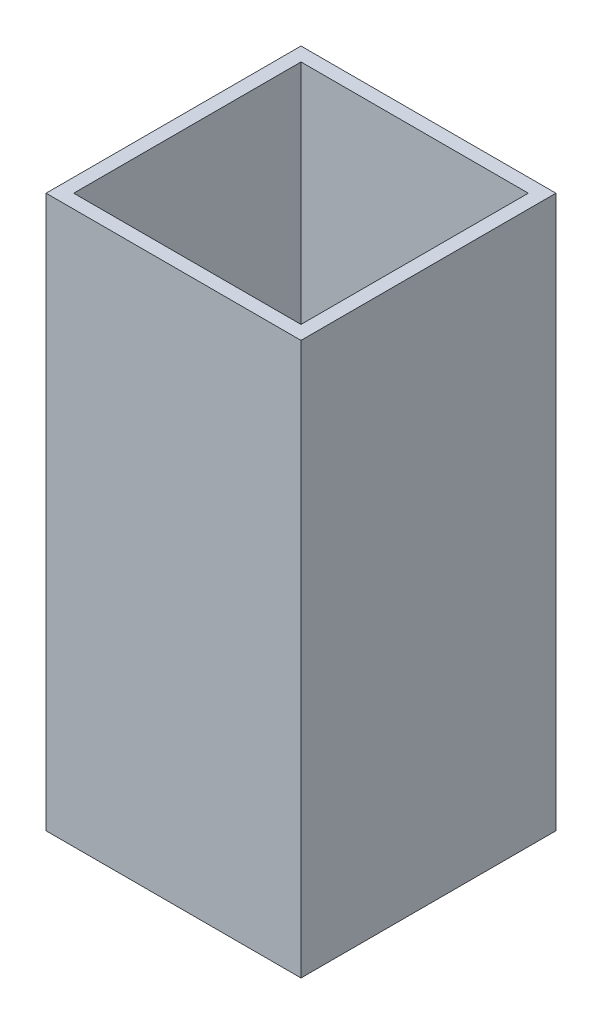
ISO-10303-21;
HEADER;
FILE_DESCRIPTION(('STEP AP214'),'2;1');
FILE_NAME('part.step','',(''),(''),'','','');
FILE_SCHEMA(('AUTOMOTIVE_DESIGN { 1 0 10303 214 1 1 1 1 }'));
ENDSEC;
DATA;
#1=APPLICATION_CONTEXT('core data for automotive mechanical design processes');
#2=APPLICATION_PROTOCOL_DEFINITION('international standard','automotive_design',2000,#1);
#3=PRODUCT_CONTEXT('',#1,'mechanical');
#4=PRODUCT('Part','Part','',(#3));
#5=PRODUCT_RELATED_PRODUCT_CATEGORY('part','',(#4));
#6=PRODUCT_DEFINITION_FORMATION('','',#4);
#7=PRODUCT_DEFINITION_CONTEXT('part definition',#1,'design');
#8=PRODUCT_DEFINITION('design','',#6,#7);
#9=PRODUCT_DEFINITION_SHAPE('','',#8);
#10=(LENGTH_UNIT() NAMED_UNIT(*) SI_UNIT(.MILLI.,.METRE.));
#11=(NAMED_UNIT(*) PLANE_ANGLE_UNIT() SI_UNIT($,.RADIAN.));
#12=(NAMED_UNIT(*) SI_UNIT($,.STERADIAN.) SOLID_ANGLE_UNIT());
#13=UNCERTAINTY_MEASURE_WITH_UNIT(LENGTH_MEASURE(1.E-05),#10,'distance_accuracy_value','');
#14=(GEOMETRIC_REPRESENTATION_CONTEXT(3) GLOBAL_UNCERTAINTY_ASSIGNED_CONTEXT((#13)) GLOBAL_UNIT_ASSIGNED_CONTEXT((#10,
#11,#12)) REPRESENTATION_CONTEXT('',''));
#15=CARTESIAN_POINT('',(0.,0.,0.));
#16=DIRECTION('',(0.,0.,1.));
#17=DIRECTION('',(1.,0.,0.));
#18=AXIS2_PLACEMENT_3D('',#15,#16,#17);
#19=CARTESIAN_POINT('',(1.385,6.,-1.385));
#20=DIRECTION('',(-1.,0.,0.));
#21=DIRECTION('',(0.,0.,1.));
#22=AXIS2_PLACEMENT_3D('',#19,#20,#21);
#23=PLANE('',#22);
#24=DIRECTION('',(0.,0.,-1.));
#25=VECTOR('',#24,1.);
#26=CARTESIAN_POINT('',(1.385,0.,-1.385));
#27=LINE('',#26,#25);
#28=CARTESIAN_POINT('',(1.385,0.,1.385));
#29=VERTEX_POINT('',#28);
#30=CARTESIAN_POINT('',(1.385,0.,-1.385));
#31=VERTEX_POINT('',#30);
#32=EDGE_CURVE('E11',#29,#31,#27,.T.);
#33=ORIENTED_EDGE('',*,*,#32,.T.);
#34=DIRECTION('',(0.,-1.,0.));
#35=VECTOR('',#34,1.);
#36=CARTESIAN_POINT('',(1.385,6.,-1.385));
#37=LINE('',#36,#35);
#38=CARTESIAN_POINT('',(1.385,6.,-1.385));
#39=VERTEX_POINT('',#38);
#40=EDGE_CURVE('E24',#39,#31,#37,.T.);
#41=ORIENTED_EDGE('',*,*,#40,.F.);
#42=DIRECTION('',(0.,0.,-1.));
#43=VECTOR('',#42,1.);
#44=CARTESIAN_POINT('',(1.385,6.,-1.385));
#45=LINE('',#44,#43);
#46=CARTESIAN_POINT('',(1.385,6.,1.385));
#47=VERTEX_POINT('',#46);
#48=EDGE_CURVE('E145',#47,#39,#45,.T.);
#49=ORIENTED_EDGE('',*,*,#48,.F.);
#50=DIRECTION('',(0.,-1.,0.));
#51=VECTOR('',#50,1.);
#52=CARTESIAN_POINT('',(1.385,6.,1.385));
#53=LINE('',#52,#51);
#54=EDGE_CURVE('E143',#47,#29,#53,.T.);
#55=ORIENTED_EDGE('',*,*,#54,.T.);
#56=EDGE_LOOP('',(#33,#41,#49,#55));
#57=FACE_BOUND('',#56,.T.);
#58=ADVANCED_FACE('F17',(#57),#23,.F.);
#59=CARTESIAN_POINT('',(-1.385,6.,-1.385));
#60=DIRECTION('',(0.,0.,1.));
#61=DIRECTION('',(1.,0.,0.));
#62=AXIS2_PLACEMENT_3D('',#59,#60,#61);
#63=PLANE('',#62);
#64=DIRECTION('',(-1.,0.,0.));
#65=VECTOR('',#64,1.);
#66=CARTESIAN_POINT('',(-1.385,0.,-1.385));
#67=LINE('',#66,#65);
#68=CARTESIAN_POINT('',(-1.385,0.,-1.385));
#69=VERTEX_POINT('',#68);
#70=EDGE_CURVE('E141',#31,#69,#67,.T.);
#71=ORIENTED_EDGE('',*,*,#70,.T.);
#72=DIRECTION('',(0.,-1.,0.));
#73=VECTOR('',#72,1.);
#74=CARTESIAN_POINT('',(-1.385,6.,-1.385));
#75=LINE('',#74,#73);
#76=CARTESIAN_POINT('',(-1.385,6.,-1.385));
#77=VERTEX_POINT('',#76);
#78=EDGE_CURVE('E138',#77,#69,#75,.T.);
#79=ORIENTED_EDGE('',*,*,#78,.F.);
#80=DIRECTION('',(-1.,0.,0.));
#81=VECTOR('',#80,1.);
#82=CARTESIAN_POINT('',(-1.385,6.,-1.385));
#83=LINE('',#82,#81);
#84=EDGE_CURVE('E135',#39,#77,#83,.T.);
#85=ORIENTED_EDGE('',*,*,#84,.F.);
#86=ORIENTED_EDGE('',*,*,#40,.T.);
#87=EDGE_LOOP('',(#71,#79,#85,#86));
#88=FACE_BOUND('',#87,.T.);
#89=ADVANCED_FACE('F149',(#88),#63,.F.);
#90=CARTESIAN_POINT('',(-1.385,6.,-1.385));
#91=DIRECTION('',(1.,0.,0.));
#92=DIRECTION('',(0.,0.,-1.));
#93=AXIS2_PLACEMENT_3D('',#90,#91,#92);
#94=PLANE('',#93);
#95=DIRECTION('',(0.,0.,1.));
#96=VECTOR('',#95,1.);
#97=CARTESIAN_POINT('',(-1.385,0.,-1.385));
#98=LINE('',#97,#96);
#99=CARTESIAN_POINT('',(-1.385,0.,1.385));
#100=VERTEX_POINT('',#99);
#101=EDGE_CURVE('E133',#69,#100,#98,.T.);
#102=ORIENTED_EDGE('',*,*,#101,.T.);
#103=DIRECTION('',(0.,-1.,0.));
#104=VECTOR('',#103,1.);
#105=CARTESIAN_POINT('',(-1.385,6.,1.385));
#106=LINE('',#105,#104);
#107=CARTESIAN_POINT('',(-1.385,6.,1.385));
#108=VERTEX_POINT('',#107);
#109=EDGE_CURVE('E130',#108,#100,#106,.T.);
#110=ORIENTED_EDGE('',*,*,#109,.F.);
#111=DIRECTION('',(0.,0.,1.));
#112=VECTOR('',#111,1.);
#113=CARTESIAN_POINT('',(-1.385,6.,-1.385));
#114=LINE('',#113,#112);
#115=EDGE_CURVE('E127',#77,#108,#114,.T.);
#116=ORIENTED_EDGE('',*,*,#115,.F.);
#117=ORIENTED_EDGE('',*,*,#78,.T.);
#118=EDGE_LOOP('',(#102,#110,#116,#117));
#119=FACE_BOUND('',#118,.T.);
#120=ADVANCED_FACE('F152',(#119),#94,.F.);
#121=CARTESIAN_POINT('',(-1.385,6.,1.385));
#122=DIRECTION('',(0.,0.,-1.));
#123=DIRECTION('',(-1.,0.,0.));
#124=AXIS2_PLACEMENT_3D('',#121,#122,#123);
#125=PLANE('',#124);
#126=DIRECTION('',(1.,0.,0.));
#127=VECTOR('',#126,1.);
#128=CARTESIAN_POINT('',(-1.385,0.,1.385));
#129=LINE('',#128,#127);
#130=EDGE_CURVE('E124',#100,#29,#129,.T.);
#131=ORIENTED_EDGE('',*,*,#130,.T.);
#132=ORIENTED_EDGE('',*,*,#54,.F.);
#133=DIRECTION('',(1.,0.,0.));
#134=VECTOR('',#133,1.);
#135=CARTESIAN_POINT('',(-1.385,6.,1.385));
#136=LINE('',#135,#134);
#137=EDGE_CURVE('E121',#108,#47,#136,.T.);
#138=ORIENTED_EDGE('',*,*,#137,.F.);
#139=ORIENTED_EDGE('',*,*,#109,.T.);
#140=EDGE_LOOP('',(#131,#132,#138,#139));
#141=FACE_BOUND('',#140,.T.);
#142=ADVANCED_FACE('F156',(#141),#125,.F.);
#143=CARTESIAN_POINT('',(1.385,6.,1.385));
#144=DIRECTION('',(0.,1.,0.));
#145=DIRECTION('',(0.,0.,1.));
#146=AXIS2_PLACEMENT_3D('',#143,#144,#145);
#147=PLANE('',#146);
#148=DIRECTION('',(0.,0.,1.));
#149=VECTOR('',#148,1.);
#150=CARTESIAN_POINT('',(-1.235,6.,-1.235));
#151=LINE('',#150,#149);
#152=CARTESIAN_POINT('',(-1.235,6.,-1.235));
#153=VERTEX_POINT('',#152);
#154=CARTESIAN_POINT('',(-1.235,6.,1.235));
#155=VERTEX_POINT('',#154);
#156=EDGE_CURVE('E119',#153,#155,#151,.T.);
#157=ORIENTED_EDGE('',*,*,#156,.F.);
#158=DIRECTION('',(-1.,0.,0.));
#159=VECTOR('',#158,1.);
#160=CARTESIAN_POINT('',(-1.235,6.,-1.235));
#161=LINE('',#160,#159);
#162=CARTESIAN_POINT('',(1.235,6.,-1.235));
#163=VERTEX_POINT('',#162);
#164=EDGE_CURVE('E116',#163,#153,#161,.T.);
#165=ORIENTED_EDGE('',*,*,#164,.F.);
#166=DIRECTION('',(0.,0.,-1.));
#167=VECTOR('',#166,1.);
#168=CARTESIAN_POINT('',(1.235,6.,-1.235));
#169=LINE('',#168,#167);
#170=CARTESIAN_POINT('',(1.235,6.,1.235));
#171=VERTEX_POINT('',#170);
#172=EDGE_CURVE('E114',#171,#163,#169,.T.);
#173=ORIENTED_EDGE('',*,*,#172,.F.);
#174=DIRECTION('',(1.,0.,0.));
#175=VECTOR('',#174,1.);
#176=CARTESIAN_POINT('',(-1.235,6.,1.235));
#177=LINE('',#176,#175);
#178=EDGE_CURVE('E102',#155,#171,#177,.T.);
#179=ORIENTED_EDGE('',*,*,#178,.F.);
#180=EDGE_LOOP('',(#157,#165,#173,#179));
#181=FACE_BOUND('',#180,.T.);
#182=ORIENTED_EDGE('',*,*,#48,.T.);
#183=ORIENTED_EDGE('',*,*,#84,.T.);
#184=ORIENTED_EDGE('',*,*,#115,.T.);
#185=ORIENTED_EDGE('',*,*,#137,.T.);
#186=EDGE_LOOP('',(#182,#183,#184,#185));
#187=FACE_BOUND('',#186,.T.);
#188=ADVANCED_FACE('F159',(#181,#187),#147,.T.);
#189=CARTESIAN_POINT('',(1.385,0.,1.385));
#190=DIRECTION('',(0.,1.,0.));
#191=DIRECTION('',(0.,0.,1.));
#192=AXIS2_PLACEMENT_3D('',#189,#190,#191);
#193=PLANE('',#192);
#194=DIRECTION('',(-1.,0.,0.));
#195=VECTOR('',#194,1.);
#196=CARTESIAN_POINT('',(1.385,0.,-1.235));
#197=LINE('',#196,#195);
#198=CARTESIAN_POINT('',(1.235,0.,-1.235));
#199=VERTEX_POINT('',#198);
#200=CARTESIAN_POINT('',(-1.235,0.,-1.235));
#201=VERTEX_POINT('',#200);
#202=EDGE_CURVE('E111',#199,#201,#197,.T.);
#203=ORIENTED_EDGE('',*,*,#202,.T.);
#204=DIRECTION('',(0.,0.,1.));
#205=VECTOR('',#204,1.);
#206=CARTESIAN_POINT('',(-1.235,0.,1.385));
#207=LINE('',#206,#205);
#208=CARTESIAN_POINT('',(-1.235,0.,1.235));
#209=VERTEX_POINT('',#208);
#210=EDGE_CURVE('E84',#201,#209,#207,.T.);
#211=ORIENTED_EDGE('',*,*,#210,.T.);
#212=DIRECTION('',(1.,0.,0.));
#213=VECTOR('',#212,1.);
#214=CARTESIAN_POINT('',(1.385,0.,1.235));
#215=LINE('',#214,#213);
#216=CARTESIAN_POINT('',(1.235,0.,1.235));
#217=VERTEX_POINT('',#216);
#218=EDGE_CURVE('E78',#209,#217,#215,.T.);
#219=ORIENTED_EDGE('',*,*,#218,.T.);
#220=DIRECTION('',(0.,0.,-1.));
#221=VECTOR('',#220,1.);
#222=CARTESIAN_POINT('',(1.235,0.,1.385));
#223=LINE('',#222,#221);
#224=EDGE_CURVE('E81',#217,#199,#223,.T.);
#225=ORIENTED_EDGE('',*,*,#224,.T.);
#226=EDGE_LOOP('',(#203,#211,#219,#225));
#227=FACE_BOUND('',#226,.T.);
#228=ORIENTED_EDGE('',*,*,#32,.F.);
#229=ORIENTED_EDGE('',*,*,#130,.F.);
#230=ORIENTED_EDGE('',*,*,#101,.F.);
#231=ORIENTED_EDGE('',*,*,#70,.F.);
#232=EDGE_LOOP('',(#228,#229,#230,#231));
#233=FACE_BOUND('',#232,.T.);
#234=ADVANCED_FACE('F80',(#227,#233),#193,.F.);
#235=CARTESIAN_POINT('',(-1.235,-4.,-1.235));
#236=DIRECTION('',(-1.,0.,0.));
#237=DIRECTION('',(0.,0.,1.));
#238=AXIS2_PLACEMENT_3D('',#235,#236,#237);
#239=PLANE('',#238);
#240=DIRECTION('',(0.,1.,0.));
#241=VECTOR('',#240,1.);
#242=CARTESIAN_POINT('',(-1.235,-4.,-1.235));
#243=LINE('',#242,#241);
#244=EDGE_CURVE('E97',#201,#153,#243,.T.);
#245=ORIENTED_EDGE('',*,*,#244,.T.);
#246=ORIENTED_EDGE('',*,*,#156,.T.);
#247=DIRECTION('',(0.,1.,0.));
#248=VECTOR('',#247,1.);
#249=CARTESIAN_POINT('',(-1.235,-4.,1.235));
#250=LINE('',#249,#248);
#251=EDGE_CURVE('E104',#209,#155,#250,.T.);
#252=ORIENTED_EDGE('',*,*,#251,.F.);
#253=ORIENTED_EDGE('',*,*,#210,.F.);
#254=EDGE_LOOP('',(#245,#246,#252,#253));
#255=FACE_BOUND('',#254,.T.);
#256=ADVANCED_FACE('F177',(#255),#239,.F.);
#257=CARTESIAN_POINT('',(-1.235,-4.,-1.235));
#258=DIRECTION('',(0.,0.,-1.));
#259=DIRECTION('',(-1.,0.,0.));
#260=AXIS2_PLACEMENT_3D('',#257,#258,#259);
#261=PLANE('',#260);
#262=DIRECTION('',(0.,1.,0.));
#263=VECTOR('',#262,1.);
#264=CARTESIAN_POINT('',(1.235,-4.,-1.235));
#265=LINE('',#264,#263);
#266=EDGE_CURVE('E96',#199,#163,#265,.T.);
#267=ORIENTED_EDGE('',*,*,#266,.T.);
#268=ORIENTED_EDGE('',*,*,#164,.T.);
#269=ORIENTED_EDGE('',*,*,#244,.F.);
#270=ORIENTED_EDGE('',*,*,#202,.F.);
#271=EDGE_LOOP('',(#267,#268,#269,#270));
#272=FACE_BOUND('',#271,.T.);
#273=ADVANCED_FACE('F180',(#272),#261,.F.);
#274=CARTESIAN_POINT('',(1.235,-4.,-1.235));
#275=DIRECTION('',(1.,0.,0.));
#276=DIRECTION('',(0.,0.,-1.));
#277=AXIS2_PLACEMENT_3D('',#274,#275,#276);
#278=PLANE('',#277);
#279=DIRECTION('',(0.,1.,0.));
#280=VECTOR('',#279,1.);
#281=CARTESIAN_POINT('',(1.235,-4.,1.235));
#282=LINE('',#281,#280);
#283=EDGE_CURVE('E94',#217,#171,#282,.T.);
#284=ORIENTED_EDGE('',*,*,#283,.T.);
#285=ORIENTED_EDGE('',*,*,#172,.T.);
#286=ORIENTED_EDGE('',*,*,#266,.F.);
#287=ORIENTED_EDGE('',*,*,#224,.F.);
#288=EDGE_LOOP('',(#284,#285,#286,#287));
#289=FACE_BOUND('',#288,.T.);
#290=ADVANCED_FACE('F92',(#289),#278,.F.);
#291=CARTESIAN_POINT('',(-1.235,-4.,1.235));
#292=DIRECTION('',(0.,0.,1.));
#293=DIRECTION('',(1.,0.,0.));
#294=AXIS2_PLACEMENT_3D('',#291,#292,#293);
#295=PLANE('',#294);
#296=ORIENTED_EDGE('',*,*,#251,.T.);
#297=ORIENTED_EDGE('',*,*,#178,.T.);
#298=ORIENTED_EDGE('',*,*,#283,.F.);
#299=ORIENTED_EDGE('',*,*,#218,.F.);
#300=EDGE_LOOP('',(#296,#297,#298,#299));
#301=FACE_BOUND('',#300,.T.);
#302=ADVANCED_FACE('F100',(#301),#295,.F.);
#303=CLOSED_SHELL('',(#58,#89,#120,#142,#188,#234,#256,#273,#290,#302));
#304=MANIFOLD_SOLID_BREP('B1',#303);
#305=ADVANCED_BREP_SHAPE_REPRESENTATION('',(#18,#304),#14);
#306=SHAPE_DEFINITION_REPRESENTATION(#9,#305);
ENDSEC;
END-ISO-10303-21;
